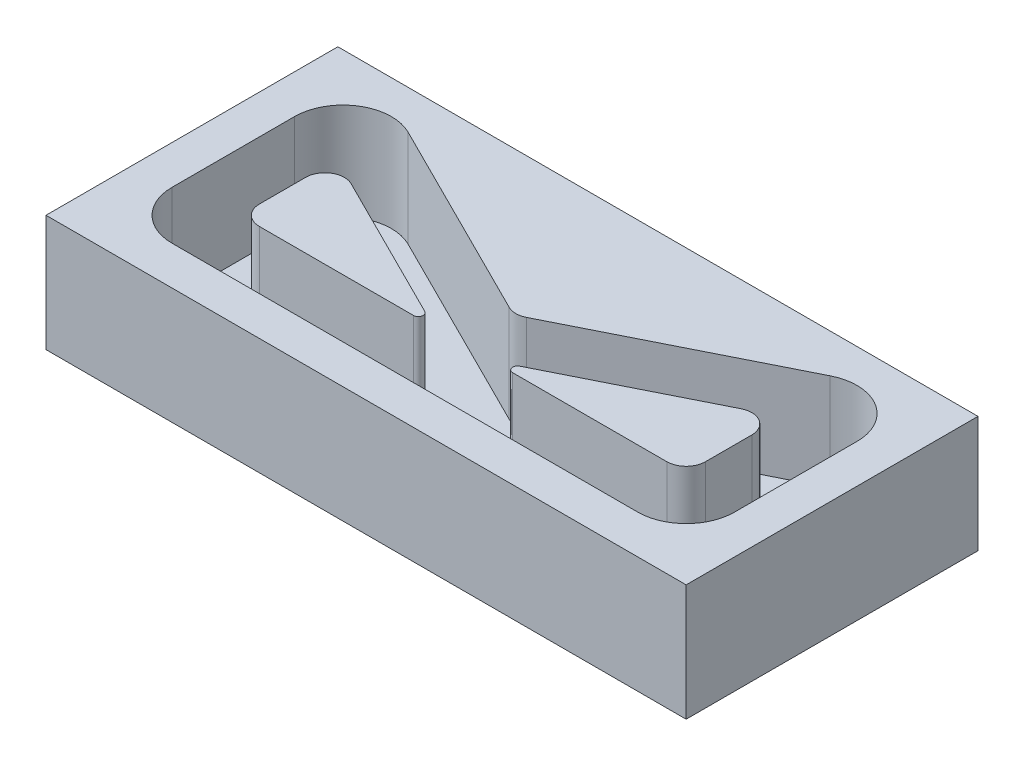
ISO-10303-21;
HEADER;
FILE_DESCRIPTION(('STEP AP214'),'2;1');
FILE_NAME('part.step','',(''),(''),'','','');
FILE_SCHEMA(('AUTOMOTIVE_DESIGN { 1 0 10303 214 1 1 1 1 }'));
ENDSEC;
DATA;
#1=APPLICATION_CONTEXT('core data for automotive mechanical design processes');
#2=APPLICATION_PROTOCOL_DEFINITION('international standard','automotive_design',2000,#1);
#3=PRODUCT_CONTEXT('',#1,'mechanical');
#4=PRODUCT('Part','Part','',(#3));
#5=PRODUCT_RELATED_PRODUCT_CATEGORY('part','',(#4));
#6=PRODUCT_DEFINITION_FORMATION('','',#4);
#7=PRODUCT_DEFINITION_CONTEXT('part definition',#1,'design');
#8=PRODUCT_DEFINITION('design','',#6,#7);
#9=PRODUCT_DEFINITION_SHAPE('','',#8);
#10=(LENGTH_UNIT() NAMED_UNIT(*) SI_UNIT(.MILLI.,.METRE.));
#11=(NAMED_UNIT(*) PLANE_ANGLE_UNIT() SI_UNIT($,.RADIAN.));
#12=(NAMED_UNIT(*) SI_UNIT($,.STERADIAN.) SOLID_ANGLE_UNIT());
#13=UNCERTAINTY_MEASURE_WITH_UNIT(LENGTH_MEASURE(1.E-05),#10,'distance_accuracy_value','');
#14=(GEOMETRIC_REPRESENTATION_CONTEXT(3) GLOBAL_UNCERTAINTY_ASSIGNED_CONTEXT((#13)) GLOBAL_UNIT_ASSIGNED_CONTEXT((#10,
#11,#12)) REPRESENTATION_CONTEXT('',''));
#15=CARTESIAN_POINT('',(0.,0.,0.));
#16=DIRECTION('',(0.,0.,1.));
#17=DIRECTION('',(1.,0.,0.));
#18=AXIS2_PLACEMENT_3D('',#15,#16,#17);
#19=CARTESIAN_POINT('',(0.,0.,0.));
#20=DIRECTION('',(0.,-1.,0.));
#21=DIRECTION('',(0.,0.,-1.));
#22=AXIS2_PLACEMENT_3D('',#19,#20,#21);
#23=PLANE('',#22);
#24=CARTESIAN_POINT('',(1.5,0.,-3.72213595499958));
#25=DIRECTION('',(0.,1.,0.));
#26=DIRECTION('',(0.,0.,1.));
#27=AXIS2_PLACEMENT_3D('',#24,#25,#26);
#28=CIRCLE('',#27,1.);
#29=CARTESIAN_POINT('',(1.94721359549996,0.,-2.82770876399967));
#30=VERTEX_POINT('',#29);
#31=CARTESIAN_POINT('',(1.05278640450004,0.,-2.82770876399967));
#32=VERTEX_POINT('',#31);
#33=EDGE_CURVE('E382',#30,#32,#28,.F.);
#34=ORIENTED_EDGE('',*,*,#33,.T.);
#35=DIRECTION('',(-0.894427190999916,0.,-0.447213595499958));
#36=VECTOR('',#35,1.);
#37=CARTESIAN_POINT('',(1.34164078649987,0.,-2.68328157299975));
#38=LINE('',#37,#36);
#39=CARTESIAN_POINT('',(-9.38196601125008,0.,-8.04508497187472));
#40=VERTEX_POINT('',#39);
#41=EDGE_CURVE('E387',#32,#40,#38,.T.);
#42=ORIENTED_EDGE('',*,*,#41,.T.);
#43=CARTESIAN_POINT('',(-10.5,0.,-5.80901699437495));
#44=DIRECTION('',(0.,1.,0.));
#45=DIRECTION('',(0.,0.,1.));
#46=AXIS2_PLACEMENT_3D('',#43,#44,#45);
#47=CIRCLE('',#46,2.5);
#48=CARTESIAN_POINT('',(-13.,0.,-5.80901699437492));
#49=VERTEX_POINT('',#48);
#50=EDGE_CURVE('E443',#40,#49,#47,.T.);
#51=ORIENTED_EDGE('',*,*,#50,.T.);
#52=DIRECTION('',(0.,0.,1.));
#53=VECTOR('',#52,1.);
#54=CARTESIAN_POINT('',(-13.,0.,0.));
#55=LINE('',#54,#53);
#56=CARTESIAN_POINT('',(-13.,0.,0.499999999999982));
#57=VERTEX_POINT('',#56);
#58=EDGE_CURVE('E440',#49,#57,#55,.T.);
#59=ORIENTED_EDGE('',*,*,#58,.T.);
#60=CARTESIAN_POINT('',(-10.5,0.,0.5));
#61=DIRECTION('',(0.,1.,0.));
#62=DIRECTION('',(0.,0.,1.));
#63=AXIS2_PLACEMENT_3D('',#60,#61,#62);
#64=CIRCLE('',#63,2.5);
#65=CARTESIAN_POINT('',(-10.5,0.,3.));
#66=VERTEX_POINT('',#65);
#67=EDGE_CURVE('E437',#66,#57,#64,.F.);
#68=ORIENTED_EDGE('',*,*,#67,.F.);
#69=DIRECTION('',(1.,0.,0.));
#70=VECTOR('',#69,1.);
#71=CARTESIAN_POINT('',(0.,0.,3.));
#72=LINE('',#71,#70);
#73=CARTESIAN_POINT('',(13.5,0.,3.));
#74=VERTEX_POINT('',#73);
#75=EDGE_CURVE('E434',#66,#74,#72,.T.);
#76=ORIENTED_EDGE('',*,*,#75,.T.);
#77=CARTESIAN_POINT('',(13.5,0.,0.5));
#78=DIRECTION('',(0.,1.,0.));
#79=DIRECTION('',(0.,0.,1.));
#80=AXIS2_PLACEMENT_3D('',#77,#78,#79);
#81=CIRCLE('',#80,2.5);
#82=CARTESIAN_POINT('',(16.,0.,0.499999999999982));
#83=VERTEX_POINT('',#82);
#84=EDGE_CURVE('E431',#74,#83,#81,.T.);
#85=ORIENTED_EDGE('',*,*,#84,.T.);
#86=DIRECTION('',(0.,0.,1.));
#87=VECTOR('',#86,1.);
#88=CARTESIAN_POINT('',(16.,0.,0.));
#89=LINE('',#88,#87);
#90=CARTESIAN_POINT('',(16.,0.,-5.80901699437492));
#91=VERTEX_POINT('',#90);
#92=EDGE_CURVE('E428',#91,#83,#89,.T.);
#93=ORIENTED_EDGE('',*,*,#92,.F.);
#94=CARTESIAN_POINT('',(13.5,0.,-5.80901699437495));
#95=DIRECTION('',(0.,1.,0.));
#96=DIRECTION('',(0.,0.,1.));
#97=AXIS2_PLACEMENT_3D('',#94,#95,#96);
#98=CIRCLE('',#97,2.5);
#99=CARTESIAN_POINT('',(12.3819660112501,0.,-8.04508497187472));
#100=VERTEX_POINT('',#99);
#101=EDGE_CURVE('E426',#100,#91,#98,.F.);
#102=ORIENTED_EDGE('',*,*,#101,.F.);
#103=DIRECTION('',(0.894427190999916,0.,-0.447213595499958));
#104=VECTOR('',#103,1.);
#105=CARTESIAN_POINT('',(-0.741640786499874,0.,-1.48328157299975));
#106=LINE('',#105,#104);
#107=EDGE_CURVE('E424',#30,#100,#106,.T.);
#108=ORIENTED_EDGE('',*,*,#107,.F.);
#109=EDGE_LOOP('',(#34,#42,#51,#59,#68,#76,#85,#93,#102,#108));
#110=FACE_BOUND('',#109,.T.);
#111=DIRECTION('',(1.,0.,0.));
#112=VECTOR('',#111,1.);
#113=CARTESIAN_POINT('',(0.,0.,0.));
#114=LINE('',#113,#112);
#115=CARTESIAN_POINT('',(-8.99999999999999,0.,0.));
#116=VERTEX_POINT('',#115);
#117=CARTESIAN_POINT('',(-1.05901699437496,0.,0.));
#118=VERTEX_POINT('',#117);
#119=EDGE_CURVE('E278',#116,#118,#114,.T.);
#120=ORIENTED_EDGE('',*,*,#119,.F.);
#121=CARTESIAN_POINT('',(-9.,0.,-1.));
#122=DIRECTION('',(0.,1.,0.));
#123=DIRECTION('',(0.,0.,1.));
#124=AXIS2_PLACEMENT_3D('',#121,#122,#123);
#125=CIRCLE('',#124,1.);
#126=CARTESIAN_POINT('',(-10.,0.,-1.00000000000001));
#127=VERTEX_POINT('',#126);
#128=EDGE_CURVE('E330',#116,#127,#125,.F.);
#129=ORIENTED_EDGE('',*,*,#128,.T.);
#130=DIRECTION('',(0.,0.,1.));
#131=VECTOR('',#130,1.);
#132=CARTESIAN_POINT('',(-10.,0.,0.));
#133=LINE('',#132,#131);
#134=CARTESIAN_POINT('',(-10.,0.,-3.38196601125009));
#135=VERTEX_POINT('',#134);
#136=EDGE_CURVE('E353',#135,#127,#133,.T.);
#137=ORIENTED_EDGE('',*,*,#136,.F.);
#138=CARTESIAN_POINT('',(-9.,0.,-3.38196601125011));
#139=DIRECTION('',(0.,1.,0.));
#140=DIRECTION('',(0.,0.,1.));
#141=AXIS2_PLACEMENT_3D('',#138,#139,#140);
#142=CIRCLE('',#141,1.);
#143=CARTESIAN_POINT('',(-8.55278640450003,0.,-4.27639320225001));
#144=VERTEX_POINT('',#143);
#145=EDGE_CURVE('E350',#135,#144,#142,.F.);
#146=ORIENTED_EDGE('',*,*,#145,.T.);
#147=DIRECTION('',(-0.894427190999916,0.,-0.447213595499958));
#148=VECTOR('',#147,1.);
#149=CARTESIAN_POINT('',(0.,0.,0.));
#150=LINE('',#149,#148);
#151=CARTESIAN_POINT('',(-0.947213595499973,0.,-0.473606797749986));
#152=VERTEX_POINT('',#151);
#153=EDGE_CURVE('E347',#152,#144,#150,.T.);
#154=ORIENTED_EDGE('',*,*,#153,.F.);
#155=CARTESIAN_POINT('',(-1.05901699437495,0.,-0.25));
#156=DIRECTION('',(0.,1.,0.));
#157=DIRECTION('',(0.,0.,1.));
#158=AXIS2_PLACEMENT_3D('',#155,#156,#157);
#159=CIRCLE('',#158,0.25);
#160=EDGE_CURVE('E345',#118,#152,#159,.T.);
#161=ORIENTED_EDGE('',*,*,#160,.F.);
#162=EDGE_LOOP('',(#120,#129,#137,#146,#154,#161));
#163=FACE_BOUND('',#162,.T.);
#164=CARTESIAN_POINT('',(4.05901699437495,0.,-0.25));
#165=DIRECTION('',(0.,1.,0.));
#166=DIRECTION('',(0.,0.,1.));
#167=AXIS2_PLACEMENT_3D('',#164,#165,#166);
#168=CIRCLE('',#167,0.25);
#169=CARTESIAN_POINT('',(3.94721359549997,0.,-0.473606797749986));
#170=VERTEX_POINT('',#169);
#171=CARTESIAN_POINT('',(4.05901699437496,0.,0.));
#172=VERTEX_POINT('',#171);
#173=EDGE_CURVE('E114',#170,#172,#168,.T.);
#174=ORIENTED_EDGE('',*,*,#173,.F.);
#175=DIRECTION('',(0.894427190999916,0.,-0.447213595499958));
#176=VECTOR('',#175,1.);
#177=CARTESIAN_POINT('',(0.6,0.,1.2));
#178=LINE('',#177,#176);
#179=CARTESIAN_POINT('',(11.5527864045,0.,-4.27639320225002));
#180=VERTEX_POINT('',#179);
#181=EDGE_CURVE('E276',#170,#180,#178,.T.);
#182=ORIENTED_EDGE('',*,*,#181,.T.);
#183=CARTESIAN_POINT('',(12.,0.,-3.38196601125011));
#184=DIRECTION('',(0.,1.,0.));
#185=DIRECTION('',(0.,0.,1.));
#186=AXIS2_PLACEMENT_3D('',#183,#184,#185);
#187=CIRCLE('',#186,1.);
#188=CARTESIAN_POINT('',(13.,0.,-3.38196601125009));
#189=VERTEX_POINT('',#188);
#190=EDGE_CURVE('E294',#189,#180,#187,.T.);
#191=ORIENTED_EDGE('',*,*,#190,.F.);
#192=DIRECTION('',(0.,0.,1.));
#193=VECTOR('',#192,1.);
#194=CARTESIAN_POINT('',(13.,0.,0.));
#195=LINE('',#194,#193);
#196=CARTESIAN_POINT('',(13.,0.,-1.00000000000001));
#197=VERTEX_POINT('',#196);
#198=EDGE_CURVE('E297',#189,#197,#195,.T.);
#199=ORIENTED_EDGE('',*,*,#198,.T.);
#200=CARTESIAN_POINT('',(12.,0.,-1.));
#201=DIRECTION('',(0.,1.,0.));
#202=DIRECTION('',(0.,0.,1.));
#203=AXIS2_PLACEMENT_3D('',#200,#201,#202);
#204=CIRCLE('',#203,1.);
#205=CARTESIAN_POINT('',(12.,0.,0.));
#206=VERTEX_POINT('',#205);
#207=EDGE_CURVE('E311',#206,#197,#204,.T.);
#208=ORIENTED_EDGE('',*,*,#207,.F.);
#209=DIRECTION('',(-1.,0.,0.));
#210=VECTOR('',#209,1.);
#211=CARTESIAN_POINT('',(0.,0.,0.));
#212=LINE('',#211,#210);
#213=EDGE_CURVE('E119',#206,#172,#212,.T.);
#214=ORIENTED_EDGE('',*,*,#213,.T.);
#215=EDGE_LOOP('',(#174,#182,#191,#199,#208,#214));
#216=FACE_BOUND('',#215,.T.);
#217=ADVANCED_FACE('F97',(#110,#163,#216),#23,.F.);
#218=CARTESIAN_POINT('',(0.,5.,5.));
#219=DIRECTION('',(0.,0.,-1.));
#220=DIRECTION('',(-1.,0.,0.));
#221=AXIS2_PLACEMENT_3D('',#218,#219,#220);
#222=PLANE('',#221);
#223=DIRECTION('',(0.,-1.,0.));
#224=VECTOR('',#223,1.);
#225=CARTESIAN_POINT('',(-15.,5.,5.));
#226=LINE('',#225,#224);
#227=CARTESIAN_POINT('',(-15.,5.,5.));
#228=VERTEX_POINT('',#227);
#229=CARTESIAN_POINT('',(-15.,-1.,5.));
#230=VERTEX_POINT('',#229);
#231=EDGE_CURVE('E448',#228,#230,#226,.T.);
#232=ORIENTED_EDGE('',*,*,#231,.T.);
#233=DIRECTION('',(-1.,0.,0.));
#234=VECTOR('',#233,1.);
#235=CARTESIAN_POINT('',(18.,-1.,5.));
#236=LINE('',#235,#234);
#237=CARTESIAN_POINT('',(18.,-1.,5.));
#238=VERTEX_POINT('',#237);
#239=EDGE_CURVE('E373',#238,#230,#236,.T.);
#240=ORIENTED_EDGE('',*,*,#239,.F.);
#241=DIRECTION('',(0.,-1.,0.));
#242=VECTOR('',#241,1.);
#243=CARTESIAN_POINT('',(18.,5.,5.));
#244=LINE('',#243,#242);
#245=CARTESIAN_POINT('',(18.,5.,5.));
#246=VERTEX_POINT('',#245);
#247=EDGE_CURVE('E12',#246,#238,#244,.T.);
#248=ORIENTED_EDGE('',*,*,#247,.F.);
#249=DIRECTION('',(1.,0.,0.));
#250=VECTOR('',#249,1.);
#251=CARTESIAN_POINT('',(0.,5.,5.));
#252=LINE('',#251,#250);
#253=EDGE_CURVE('E410',#228,#246,#252,.T.);
#254=ORIENTED_EDGE('',*,*,#253,.F.);
#255=EDGE_LOOP('',(#232,#240,#248,#254));
#256=FACE_BOUND('',#255,.T.);
#257=ADVANCED_FACE('F527',(#256),#222,.F.);
#258=CARTESIAN_POINT('',(18.,5.,0.));
#259=DIRECTION('',(-1.,0.,0.));
#260=DIRECTION('',(0.,0.,1.));
#261=AXIS2_PLACEMENT_3D('',#258,#259,#260);
#262=PLANE('',#261);
#263=ORIENTED_EDGE('',*,*,#247,.T.);
#264=DIRECTION('',(0.,0.,1.));
#265=VECTOR('',#264,1.);
#266=CARTESIAN_POINT('',(18.,-1.,-10.0450849718747));
#267=LINE('',#266,#265);
#268=CARTESIAN_POINT('',(18.,-1.,-10.0450849718747));
#269=VERTEX_POINT('',#268);
#270=EDGE_CURVE('E370',#269,#238,#267,.T.);
#271=ORIENTED_EDGE('',*,*,#270,.F.);
#272=DIRECTION('',(0.,-1.,0.));
#273=VECTOR('',#272,1.);
#274=CARTESIAN_POINT('',(18.,5.,-10.0450849718747));
#275=LINE('',#274,#273);
#276=CARTESIAN_POINT('',(18.,5.,-10.0450849718747));
#277=VERTEX_POINT('',#276);
#278=EDGE_CURVE('E106',#277,#269,#275,.T.);
#279=ORIENTED_EDGE('',*,*,#278,.F.);
#280=DIRECTION('',(0.,0.,-1.));
#281=VECTOR('',#280,1.);
#282=CARTESIAN_POINT('',(18.,5.,0.));
#283=LINE('',#282,#281);
#284=EDGE_CURVE('E413',#246,#277,#283,.T.);
#285=ORIENTED_EDGE('',*,*,#284,.F.);
#286=EDGE_LOOP('',(#263,#271,#279,#285));
#287=FACE_BOUND('',#286,.T.);
#288=ADVANCED_FACE('F532',(#287),#262,.F.);
#289=CARTESIAN_POINT('',(0.,5.,-10.0450849718747));
#290=DIRECTION('',(0.,0.,-1.));
#291=DIRECTION('',(-1.,0.,0.));
#292=AXIS2_PLACEMENT_3D('',#289,#290,#291);
#293=PLANE('',#292);
#294=ORIENTED_EDGE('',*,*,#278,.T.);
#295=DIRECTION('',(1.,0.,0.));
#296=VECTOR('',#295,1.);
#297=CARTESIAN_POINT('',(-15.,-1.,-10.0450849718747));
#298=LINE('',#297,#296);
#299=CARTESIAN_POINT('',(-15.,-1.,-10.0450849718747));
#300=VERTEX_POINT('',#299);
#301=EDGE_CURVE('E379',#300,#269,#298,.T.);
#302=ORIENTED_EDGE('',*,*,#301,.F.);
#303=DIRECTION('',(0.,-1.,0.));
#304=VECTOR('',#303,1.);
#305=CARTESIAN_POINT('',(-15.,5.,-10.0450849718747));
#306=LINE('',#305,#304);
#307=CARTESIAN_POINT('',(-15.,5.,-10.0450849718747));
#308=VERTEX_POINT('',#307);
#309=EDGE_CURVE('E450',#308,#300,#306,.T.);
#310=ORIENTED_EDGE('',*,*,#309,.F.);
#311=DIRECTION('',(1.,0.,0.));
#312=VECTOR('',#311,1.);
#313=CARTESIAN_POINT('',(0.,5.,-10.0450849718747));
#314=LINE('',#313,#312);
#315=EDGE_CURVE('E415',#308,#277,#314,.T.);
#316=ORIENTED_EDGE('',*,*,#315,.T.);
#317=EDGE_LOOP('',(#294,#302,#310,#316));
#318=FACE_BOUND('',#317,.T.);
#319=ADVANCED_FACE('F545',(#318),#293,.T.);
#320=CARTESIAN_POINT('',(1.5,5.,-3.72213595499958));
#321=DIRECTION('',(0.,-1.,0.));
#322=DIRECTION('',(0.,0.,-1.));
#323=AXIS2_PLACEMENT_3D('',#320,#321,#322);
#324=CYLINDRICAL_SURFACE('',#323,1.);
#325=ORIENTED_EDGE('',*,*,#33,.F.);
#326=DIRECTION('',(0.,-1.,0.));
#327=VECTOR('',#326,1.);
#328=CARTESIAN_POINT('',(1.94721359549996,5.,-2.82770876399967));
#329=LINE('',#328,#327);
#330=CARTESIAN_POINT('',(1.94721359549996,5.,-2.82770876399967));
#331=VERTEX_POINT('',#330);
#332=EDGE_CURVE('E101',#331,#30,#329,.T.);
#333=ORIENTED_EDGE('',*,*,#332,.F.);
#334=CARTESIAN_POINT('',(1.5,5.,-3.72213595499958));
#335=DIRECTION('',(0.,1.,0.));
#336=DIRECTION('',(0.,0.,1.));
#337=AXIS2_PLACEMENT_3D('',#334,#335,#336);
#338=CIRCLE('',#337,1.);
#339=CARTESIAN_POINT('',(1.05278640450004,5.,-2.82770876399967));
#340=VERTEX_POINT('',#339);
#341=EDGE_CURVE('E383',#331,#340,#338,.F.);
#342=ORIENTED_EDGE('',*,*,#341,.T.);
#343=DIRECTION('',(0.,-1.,0.));
#344=VECTOR('',#343,1.);
#345=CARTESIAN_POINT('',(1.05278640450004,5.,-2.82770876399967));
#346=LINE('',#345,#344);
#347=EDGE_CURVE('E421',#340,#32,#346,.T.);
#348=ORIENTED_EDGE('',*,*,#347,.T.);
#349=EDGE_LOOP('',(#325,#333,#342,#348));
#350=FACE_BOUND('',#349,.T.);
#351=ADVANCED_FACE('F99',(#350),#324,.T.);
#352=CARTESIAN_POINT('',(-0.741640786499874,5.,-1.48328157299975));
#353=DIRECTION('',(-0.447213595499958,0.,-0.894427190999916));
#354=DIRECTION('',(-0.894427190999916,0.,0.447213595499958));
#355=AXIS2_PLACEMENT_3D('',#352,#353,#354);
#356=PLANE('',#355);
#357=ORIENTED_EDGE('',*,*,#107,.T.);
#358=DIRECTION('',(0.,-1.,0.));
#359=VECTOR('',#358,1.);
#360=CARTESIAN_POINT('',(12.3819660112501,5.,-8.04508497187472));
#361=LINE('',#360,#359);
#362=CARTESIAN_POINT('',(12.3819660112501,5.,-8.04508497187472));
#363=VERTEX_POINT('',#362);
#364=EDGE_CURVE('E469',#363,#100,#361,.T.);
#365=ORIENTED_EDGE('',*,*,#364,.F.);
#366=DIRECTION('',(0.894427190999916,0.,-0.447213595499958));
#367=VECTOR('',#366,1.);
#368=CARTESIAN_POINT('',(-0.741640786499874,5.,-1.48328157299975));
#369=LINE('',#368,#367);
#370=EDGE_CURVE('E386',#331,#363,#369,.T.);
#371=ORIENTED_EDGE('',*,*,#370,.F.);
#372=ORIENTED_EDGE('',*,*,#332,.T.);
#373=EDGE_LOOP('',(#357,#365,#371,#372));
#374=FACE_BOUND('',#373,.T.);
#375=ADVANCED_FACE('F478',(#374),#356,.F.);
#376=CARTESIAN_POINT('',(13.5,5.,-5.80901699437495));
#377=DIRECTION('',(0.,-1.,0.));
#378=DIRECTION('',(0.,0.,-1.));
#379=AXIS2_PLACEMENT_3D('',#376,#377,#378);
#380=CYLINDRICAL_SURFACE('',#379,2.5);
#381=ORIENTED_EDGE('',*,*,#101,.T.);
#382=DIRECTION('',(0.,-1.,0.));
#383=VECTOR('',#382,1.);
#384=CARTESIAN_POINT('',(16.,5.,-5.80901699437492));
#385=LINE('',#384,#383);
#386=CARTESIAN_POINT('',(16.,5.,-5.80901699437492));
#387=VERTEX_POINT('',#386);
#388=EDGE_CURVE('E467',#387,#91,#385,.T.);
#389=ORIENTED_EDGE('',*,*,#388,.F.);
#390=CARTESIAN_POINT('',(13.5,5.,-5.80901699437495));
#391=DIRECTION('',(0.,1.,0.));
#392=DIRECTION('',(0.,0.,1.));
#393=AXIS2_PLACEMENT_3D('',#390,#391,#392);
#394=CIRCLE('',#393,2.5);
#395=EDGE_CURVE('E389',#363,#387,#394,.F.);
#396=ORIENTED_EDGE('',*,*,#395,.F.);
#397=ORIENTED_EDGE('',*,*,#364,.T.);
#398=EDGE_LOOP('',(#381,#389,#396,#397));
#399=FACE_BOUND('',#398,.T.);
#400=ADVANCED_FACE('F487',(#399),#380,.F.);
#401=CARTESIAN_POINT('',(16.,5.,0.));
#402=DIRECTION('',(1.,0.,0.));
#403=DIRECTION('',(0.,0.,-1.));
#404=AXIS2_PLACEMENT_3D('',#401,#402,#403);
#405=PLANE('',#404);
#406=ORIENTED_EDGE('',*,*,#92,.T.);
#407=DIRECTION('',(0.,-1.,0.));
#408=VECTOR('',#407,1.);
#409=CARTESIAN_POINT('',(16.,5.,0.499999999999982));
#410=LINE('',#409,#408);
#411=CARTESIAN_POINT('',(16.,5.,0.499999999999982));
#412=VERTEX_POINT('',#411);
#413=EDGE_CURVE('E465',#412,#83,#410,.T.);
#414=ORIENTED_EDGE('',*,*,#413,.F.);
#415=DIRECTION('',(0.,0.,1.));
#416=VECTOR('',#415,1.);
#417=CARTESIAN_POINT('',(16.,5.,0.));
#418=LINE('',#417,#416);
#419=EDGE_CURVE('E391',#387,#412,#418,.T.);
#420=ORIENTED_EDGE('',*,*,#419,.F.);
#421=ORIENTED_EDGE('',*,*,#388,.T.);
#422=EDGE_LOOP('',(#406,#414,#420,#421));
#423=FACE_BOUND('',#422,.T.);
#424=ADVANCED_FACE('F490',(#423),#405,.F.);
#425=CARTESIAN_POINT('',(13.5,5.,0.5));
#426=DIRECTION('',(0.,-1.,0.));
#427=DIRECTION('',(0.,0.,-1.));
#428=AXIS2_PLACEMENT_3D('',#425,#426,#427);
#429=CYLINDRICAL_SURFACE('',#428,2.5);
#430=ORIENTED_EDGE('',*,*,#84,.F.);
#431=DIRECTION('',(0.,-1.,0.));
#432=VECTOR('',#431,1.);
#433=CARTESIAN_POINT('',(13.5,5.,3.));
#434=LINE('',#433,#432);
#435=CARTESIAN_POINT('',(13.5,5.,3.));
#436=VERTEX_POINT('',#435);
#437=EDGE_CURVE('E463',#436,#74,#434,.T.);
#438=ORIENTED_EDGE('',*,*,#437,.F.);
#439=CARTESIAN_POINT('',(13.5,5.,0.5));
#440=DIRECTION('',(0.,1.,0.));
#441=DIRECTION('',(0.,0.,1.));
#442=AXIS2_PLACEMENT_3D('',#439,#440,#441);
#443=CIRCLE('',#442,2.5);
#444=EDGE_CURVE('E393',#436,#412,#443,.T.);
#445=ORIENTED_EDGE('',*,*,#444,.T.);
#446=ORIENTED_EDGE('',*,*,#413,.T.);
#447=EDGE_LOOP('',(#430,#438,#445,#446));
#448=FACE_BOUND('',#447,.T.);
#449=ADVANCED_FACE('F517',(#448),#429,.F.);
#450=CARTESIAN_POINT('',(0.,5.,3.));
#451=DIRECTION('',(0.,0.,-1.));
#452=DIRECTION('',(-1.,0.,0.));
#453=AXIS2_PLACEMENT_3D('',#450,#451,#452);
#454=PLANE('',#453);
#455=ORIENTED_EDGE('',*,*,#75,.F.);
#456=DIRECTION('',(0.,-1.,0.));
#457=VECTOR('',#456,1.);
#458=CARTESIAN_POINT('',(-10.5,5.,3.));
#459=LINE('',#458,#457);
#460=CARTESIAN_POINT('',(-10.5,5.,3.));
#461=VERTEX_POINT('',#460);
#462=EDGE_CURVE('E461',#461,#66,#459,.T.);
#463=ORIENTED_EDGE('',*,*,#462,.F.);
#464=DIRECTION('',(1.,0.,0.));
#465=VECTOR('',#464,1.);
#466=CARTESIAN_POINT('',(0.,5.,3.));
#467=LINE('',#466,#465);
#468=EDGE_CURVE('E396',#461,#436,#467,.T.);
#469=ORIENTED_EDGE('',*,*,#468,.T.);
#470=ORIENTED_EDGE('',*,*,#437,.T.);
#471=EDGE_LOOP('',(#455,#463,#469,#470));
#472=FACE_BOUND('',#471,.T.);
#473=ADVANCED_FACE('F515',(#472),#454,.T.);
#474=CARTESIAN_POINT('',(-10.5,5.,0.5));
#475=DIRECTION('',(0.,-1.,0.));
#476=DIRECTION('',(0.,0.,-1.));
#477=AXIS2_PLACEMENT_3D('',#474,#475,#476);
#478=CYLINDRICAL_SURFACE('',#477,2.5);
#479=ORIENTED_EDGE('',*,*,#67,.T.);
#480=DIRECTION('',(0.,-1.,0.));
#481=VECTOR('',#480,1.);
#482=CARTESIAN_POINT('',(-13.,5.,0.499999999999982));
#483=LINE('',#482,#481);
#484=CARTESIAN_POINT('',(-13.,5.,0.499999999999982));
#485=VERTEX_POINT('',#484);
#486=EDGE_CURVE('E459',#485,#57,#483,.T.);
#487=ORIENTED_EDGE('',*,*,#486,.F.);
#488=CARTESIAN_POINT('',(-10.5,5.,0.5));
#489=DIRECTION('',(0.,1.,0.));
#490=DIRECTION('',(0.,0.,1.));
#491=AXIS2_PLACEMENT_3D('',#488,#489,#490);
#492=CIRCLE('',#491,2.5);
#493=EDGE_CURVE('E399',#461,#485,#492,.F.);
#494=ORIENTED_EDGE('',*,*,#493,.F.);
#495=ORIENTED_EDGE('',*,*,#462,.T.);
#496=EDGE_LOOP('',(#479,#487,#494,#495));
#497=FACE_BOUND('',#496,.T.);
#498=ADVANCED_FACE('F511',(#497),#478,.F.);
#499=CARTESIAN_POINT('',(-13.,5.,0.));
#500=DIRECTION('',(1.,0.,0.));
#501=DIRECTION('',(0.,0.,-1.));
#502=AXIS2_PLACEMENT_3D('',#499,#500,#501);
#503=PLANE('',#502);
#504=ORIENTED_EDGE('',*,*,#58,.F.);
#505=DIRECTION('',(0.,-1.,0.));
#506=VECTOR('',#505,1.);
#507=CARTESIAN_POINT('',(-13.,5.,-5.80901699437492));
#508=LINE('',#507,#506);
#509=CARTESIAN_POINT('',(-13.,5.,-5.80901699437492));
#510=VERTEX_POINT('',#509);
#511=EDGE_CURVE('E457',#510,#49,#508,.T.);
#512=ORIENTED_EDGE('',*,*,#511,.F.);
#513=DIRECTION('',(0.,0.,1.));
#514=VECTOR('',#513,1.);
#515=CARTESIAN_POINT('',(-13.,5.,0.));
#516=LINE('',#515,#514);
#517=EDGE_CURVE('E401',#510,#485,#516,.T.);
#518=ORIENTED_EDGE('',*,*,#517,.T.);
#519=ORIENTED_EDGE('',*,*,#486,.T.);
#520=EDGE_LOOP('',(#504,#512,#518,#519));
#521=FACE_BOUND('',#520,.T.);
#522=ADVANCED_FACE('F507',(#521),#503,.T.);
#523=CARTESIAN_POINT('',(-10.5,5.,-5.80901699437495));
#524=DIRECTION('',(0.,-1.,0.));
#525=DIRECTION('',(0.,0.,-1.));
#526=AXIS2_PLACEMENT_3D('',#523,#524,#525);
#527=CYLINDRICAL_SURFACE('',#526,2.5);
#528=ORIENTED_EDGE('',*,*,#50,.F.);
#529=DIRECTION('',(0.,-1.,0.));
#530=VECTOR('',#529,1.);
#531=CARTESIAN_POINT('',(-9.38196601125008,5.,-8.04508497187472));
#532=LINE('',#531,#530);
#533=CARTESIAN_POINT('',(-9.38196601125008,5.,-8.04508497187472));
#534=VERTEX_POINT('',#533);
#535=EDGE_CURVE('E454',#534,#40,#532,.T.);
#536=ORIENTED_EDGE('',*,*,#535,.F.);
#537=CARTESIAN_POINT('',(-10.5,5.,-5.80901699437495));
#538=DIRECTION('',(0.,1.,0.));
#539=DIRECTION('',(0.,0.,1.));
#540=AXIS2_PLACEMENT_3D('',#537,#538,#539);
#541=CIRCLE('',#540,2.5);
#542=EDGE_CURVE('E404',#534,#510,#541,.T.);
#543=ORIENTED_EDGE('',*,*,#542,.T.);
#544=ORIENTED_EDGE('',*,*,#511,.T.);
#545=EDGE_LOOP('',(#528,#536,#543,#544));
#546=FACE_BOUND('',#545,.T.);
#547=ADVANCED_FACE('F505',(#546),#527,.F.);
#548=CARTESIAN_POINT('',(1.34164078649987,5.,-2.68328157299975));
#549=DIRECTION('',(-0.447213595499958,0.,0.894427190999916));
#550=DIRECTION('',(0.894427190999916,0.,0.447213595499958));
#551=AXIS2_PLACEMENT_3D('',#548,#549,#550);
#552=PLANE('',#551);
#553=ORIENTED_EDGE('',*,*,#41,.F.);
#554=ORIENTED_EDGE('',*,*,#347,.F.);
#555=DIRECTION('',(-0.894427190999916,0.,-0.447213595499958));
#556=VECTOR('',#555,1.);
#557=CARTESIAN_POINT('',(1.34164078649987,5.,-2.68328157299975));
#558=LINE('',#557,#556);
#559=EDGE_CURVE('E407',#340,#534,#558,.T.);
#560=ORIENTED_EDGE('',*,*,#559,.T.);
#561=ORIENTED_EDGE('',*,*,#535,.T.);
#562=EDGE_LOOP('',(#553,#554,#560,#561));
#563=FACE_BOUND('',#562,.T.);
#564=ADVANCED_FACE('F501',(#563),#552,.T.);
#565=CARTESIAN_POINT('',(-15.,5.,0.));
#566=DIRECTION('',(-1.,0.,0.));
#567=DIRECTION('',(0.,0.,1.));
#568=AXIS2_PLACEMENT_3D('',#565,#566,#567);
#569=PLANE('',#568);
#570=ORIENTED_EDGE('',*,*,#309,.T.);
#571=DIRECTION('',(0.,0.,-1.));
#572=VECTOR('',#571,1.);
#573=CARTESIAN_POINT('',(-15.,-1.,5.));
#574=LINE('',#573,#572);
#575=EDGE_CURVE('E376',#230,#300,#574,.T.);
#576=ORIENTED_EDGE('',*,*,#575,.F.);
#577=ORIENTED_EDGE('',*,*,#231,.F.);
#578=DIRECTION('',(0.,0.,-1.));
#579=VECTOR('',#578,1.);
#580=CARTESIAN_POINT('',(-15.,5.,0.));
#581=LINE('',#580,#579);
#582=EDGE_CURVE('E418',#228,#308,#581,.T.);
#583=ORIENTED_EDGE('',*,*,#582,.T.);
#584=EDGE_LOOP('',(#570,#576,#577,#583));
#585=FACE_BOUND('',#584,.T.);
#586=ADVANCED_FACE('F541',(#585),#569,.T.);
#587=CARTESIAN_POINT('',(0.,5.,0.));
#588=DIRECTION('',(0.,1.,0.));
#589=DIRECTION('',(0.,0.,1.));
#590=AXIS2_PLACEMENT_3D('',#587,#588,#589);
#591=PLANE('',#590);
#592=ORIENTED_EDGE('',*,*,#341,.F.);
#593=ORIENTED_EDGE('',*,*,#370,.T.);
#594=ORIENTED_EDGE('',*,*,#395,.T.);
#595=ORIENTED_EDGE('',*,*,#419,.T.);
#596=ORIENTED_EDGE('',*,*,#444,.F.);
#597=ORIENTED_EDGE('',*,*,#468,.F.);
#598=ORIENTED_EDGE('',*,*,#493,.T.);
#599=ORIENTED_EDGE('',*,*,#517,.F.);
#600=ORIENTED_EDGE('',*,*,#542,.F.);
#601=ORIENTED_EDGE('',*,*,#559,.F.);
#602=EDGE_LOOP('',(#592,#593,#594,#595,#596,#597,#598,#599,#600,#601));
#603=FACE_BOUND('',#602,.T.);
#604=ORIENTED_EDGE('',*,*,#253,.T.);
#605=ORIENTED_EDGE('',*,*,#284,.T.);
#606=ORIENTED_EDGE('',*,*,#315,.F.);
#607=ORIENTED_EDGE('',*,*,#582,.F.);
#608=EDGE_LOOP('',(#604,#605,#606,#607));
#609=FACE_BOUND('',#608,.T.);
#610=ADVANCED_FACE('F494',(#603,#609),#591,.T.);
#611=CARTESIAN_POINT('',(0.,-1.,0.));
#612=DIRECTION('',(0.,-1.,0.));
#613=DIRECTION('',(0.,0.,-1.));
#614=AXIS2_PLACEMENT_3D('',#611,#612,#613);
#615=PLANE('',#614);
#616=ORIENTED_EDGE('',*,*,#270,.T.);
#617=ORIENTED_EDGE('',*,*,#239,.T.);
#618=ORIENTED_EDGE('',*,*,#575,.T.);
#619=ORIENTED_EDGE('',*,*,#301,.T.);
#620=EDGE_LOOP('',(#616,#617,#618,#619));
#621=FACE_BOUND('',#620,.T.);
#622=ADVANCED_FACE('F537',(#621),#615,.T.);
#623=CARTESIAN_POINT('',(0.,5.,0.));
#624=DIRECTION('',(0.,0.,-1.));
#625=DIRECTION('',(-1.,0.,0.));
#626=AXIS2_PLACEMENT_3D('',#623,#624,#625);
#627=PLANE('',#626);
#628=ORIENTED_EDGE('',*,*,#119,.T.);
#629=DIRECTION('',(0.,-1.,0.));
#630=VECTOR('',#629,1.);
#631=CARTESIAN_POINT('',(-1.05901699437496,5.,0.));
#632=LINE('',#631,#630);
#633=CARTESIAN_POINT('',(-1.05901699437496,5.,0.));
#634=VERTEX_POINT('',#633);
#635=EDGE_CURVE('E368',#634,#118,#632,.T.);
#636=ORIENTED_EDGE('',*,*,#635,.F.);
#637=DIRECTION('',(1.,0.,0.));
#638=VECTOR('',#637,1.);
#639=CARTESIAN_POINT('',(0.,5.,0.));
#640=LINE('',#639,#638);
#641=CARTESIAN_POINT('',(-8.99999999999999,5.,0.));
#642=VERTEX_POINT('',#641);
#643=EDGE_CURVE('E326',#642,#634,#640,.T.);
#644=ORIENTED_EDGE('',*,*,#643,.F.);
#645=DIRECTION('',(0.,-1.,0.));
#646=VECTOR('',#645,1.);
#647=CARTESIAN_POINT('',(-8.99999999999999,5.,0.));
#648=LINE('',#647,#646);
#649=EDGE_CURVE('E342',#642,#116,#648,.T.);
#650=ORIENTED_EDGE('',*,*,#649,.T.);
#651=EDGE_LOOP('',(#628,#636,#644,#650));
#652=FACE_BOUND('',#651,.T.);
#653=ADVANCED_FACE('F589',(#652),#627,.F.);
#654=CARTESIAN_POINT('',(-1.05901699437495,5.,-0.25));
#655=DIRECTION('',(0.,-1.,0.));
#656=DIRECTION('',(0.,0.,-1.));
#657=AXIS2_PLACEMENT_3D('',#654,#655,#656);
#658=CYLINDRICAL_SURFACE('',#657,0.25);
#659=ORIENTED_EDGE('',*,*,#160,.T.);
#660=DIRECTION('',(0.,-1.,0.));
#661=VECTOR('',#660,1.);
#662=CARTESIAN_POINT('',(-0.947213595499973,5.,-0.473606797749986));
#663=LINE('',#662,#661);
#664=CARTESIAN_POINT('',(-0.947213595499973,5.,-0.473606797749986));
#665=VERTEX_POINT('',#664);
#666=EDGE_CURVE('E365',#665,#152,#663,.T.);
#667=ORIENTED_EDGE('',*,*,#666,.F.);
#668=CARTESIAN_POINT('',(-1.05901699437495,5.,-0.25));
#669=DIRECTION('',(0.,1.,0.));
#670=DIRECTION('',(0.,0.,1.));
#671=AXIS2_PLACEMENT_3D('',#668,#669,#670);
#672=CIRCLE('',#671,0.25);
#673=EDGE_CURVE('E329',#634,#665,#672,.T.);
#674=ORIENTED_EDGE('',*,*,#673,.F.);
#675=ORIENTED_EDGE('',*,*,#635,.T.);
#676=EDGE_LOOP('',(#659,#667,#674,#675));
#677=FACE_BOUND('',#676,.T.);
#678=ADVANCED_FACE('F596',(#677),#658,.T.);
#679=CARTESIAN_POINT('',(0.,5.,0.));
#680=DIRECTION('',(-0.447213595499958,0.,0.894427190999916));
#681=DIRECTION('',(0.894427190999916,0.,0.447213595499958));
#682=AXIS2_PLACEMENT_3D('',#679,#680,#681);
#683=PLANE('',#682);
#684=ORIENTED_EDGE('',*,*,#153,.T.);
#685=DIRECTION('',(0.,-1.,0.));
#686=VECTOR('',#685,1.);
#687=CARTESIAN_POINT('',(-8.55278640450003,5.,-4.27639320225001));
#688=LINE('',#687,#686);
#689=CARTESIAN_POINT('',(-8.55278640450003,5.,-4.27639320225001));
#690=VERTEX_POINT('',#689);
#691=EDGE_CURVE('E363',#690,#144,#688,.T.);
#692=ORIENTED_EDGE('',*,*,#691,.F.);
#693=DIRECTION('',(-0.894427190999916,0.,-0.447213595499958));
#694=VECTOR('',#693,1.);
#695=CARTESIAN_POINT('',(0.,5.,0.));
#696=LINE('',#695,#694);
#697=EDGE_CURVE('E332',#665,#690,#696,.T.);
#698=ORIENTED_EDGE('',*,*,#697,.F.);
#699=ORIENTED_EDGE('',*,*,#666,.T.);
#700=EDGE_LOOP('',(#684,#692,#698,#699));
#701=FACE_BOUND('',#700,.T.);
#702=ADVANCED_FACE('F603',(#701),#683,.F.);
#703=CARTESIAN_POINT('',(-9.,5.,-3.38196601125011));
#704=DIRECTION('',(0.,-1.,0.));
#705=DIRECTION('',(0.,0.,-1.));
#706=AXIS2_PLACEMENT_3D('',#703,#704,#705);
#707=CYLINDRICAL_SURFACE('',#706,1.);
#708=ORIENTED_EDGE('',*,*,#145,.F.);
#709=DIRECTION('',(0.,-1.,0.));
#710=VECTOR('',#709,1.);
#711=CARTESIAN_POINT('',(-10.,5.,-3.38196601125009));
#712=LINE('',#711,#710);
#713=CARTESIAN_POINT('',(-10.,5.,-3.38196601125009));
#714=VERTEX_POINT('',#713);
#715=EDGE_CURVE('E361',#714,#135,#712,.T.);
#716=ORIENTED_EDGE('',*,*,#715,.F.);
#717=CARTESIAN_POINT('',(-9.,5.,-3.38196601125011));
#718=DIRECTION('',(0.,1.,0.));
#719=DIRECTION('',(0.,0.,1.));
#720=AXIS2_PLACEMENT_3D('',#717,#718,#719);
#721=CIRCLE('',#720,1.);
#722=EDGE_CURVE('E334',#714,#690,#721,.F.);
#723=ORIENTED_EDGE('',*,*,#722,.T.);
#724=ORIENTED_EDGE('',*,*,#691,.T.);
#725=EDGE_LOOP('',(#708,#716,#723,#724));
#726=FACE_BOUND('',#725,.T.);
#727=ADVANCED_FACE('F611',(#726),#707,.T.);
#728=CARTESIAN_POINT('',(-10.,5.,0.));
#729=DIRECTION('',(1.,0.,0.));
#730=DIRECTION('',(0.,0.,-1.));
#731=AXIS2_PLACEMENT_3D('',#728,#729,#730);
#732=PLANE('',#731);
#733=ORIENTED_EDGE('',*,*,#136,.T.);
#734=DIRECTION('',(0.,-1.,0.));
#735=VECTOR('',#734,1.);
#736=CARTESIAN_POINT('',(-10.,5.,-1.00000000000001));
#737=LINE('',#736,#735);
#738=CARTESIAN_POINT('',(-10.,5.,-1.00000000000001));
#739=VERTEX_POINT('',#738);
#740=EDGE_CURVE('E358',#739,#127,#737,.T.);
#741=ORIENTED_EDGE('',*,*,#740,.F.);
#742=DIRECTION('',(0.,0.,1.));
#743=VECTOR('',#742,1.);
#744=CARTESIAN_POINT('',(-10.,5.,0.));
#745=LINE('',#744,#743);
#746=EDGE_CURVE('E337',#714,#739,#745,.T.);
#747=ORIENTED_EDGE('',*,*,#746,.F.);
#748=ORIENTED_EDGE('',*,*,#715,.T.);
#749=EDGE_LOOP('',(#733,#741,#747,#748));
#750=FACE_BOUND('',#749,.T.);
#751=ADVANCED_FACE('F619',(#750),#732,.F.);
#752=CARTESIAN_POINT('',(-9.,5.,-1.));
#753=DIRECTION('',(0.,-1.,0.));
#754=DIRECTION('',(0.,0.,-1.));
#755=AXIS2_PLACEMENT_3D('',#752,#753,#754);
#756=CYLINDRICAL_SURFACE('',#755,1.);
#757=ORIENTED_EDGE('',*,*,#128,.F.);
#758=ORIENTED_EDGE('',*,*,#649,.F.);
#759=CARTESIAN_POINT('',(-9.,5.,-1.));
#760=DIRECTION('',(0.,1.,0.));
#761=DIRECTION('',(0.,0.,1.));
#762=AXIS2_PLACEMENT_3D('',#759,#760,#761);
#763=CIRCLE('',#762,1.);
#764=EDGE_CURVE('E339',#642,#739,#763,.F.);
#765=ORIENTED_EDGE('',*,*,#764,.T.);
#766=ORIENTED_EDGE('',*,*,#740,.T.);
#767=EDGE_LOOP('',(#757,#758,#765,#766));
#768=FACE_BOUND('',#767,.T.);
#769=ADVANCED_FACE('F627',(#768),#756,.T.);
#770=CARTESIAN_POINT('',(0.,5.,0.));
#771=DIRECTION('',(0.,1.,0.));
#772=DIRECTION('',(0.,0.,1.));
#773=AXIS2_PLACEMENT_3D('',#770,#771,#772);
#774=PLANE('',#773);
#775=ORIENTED_EDGE('',*,*,#643,.T.);
#776=ORIENTED_EDGE('',*,*,#673,.T.);
#777=ORIENTED_EDGE('',*,*,#697,.T.);
#778=ORIENTED_EDGE('',*,*,#722,.F.);
#779=ORIENTED_EDGE('',*,*,#746,.T.);
#780=ORIENTED_EDGE('',*,*,#764,.F.);
#781=EDGE_LOOP('',(#775,#776,#777,#778,#779,#780));
#782=FACE_BOUND('',#781,.T.);
#783=ADVANCED_FACE('F635',(#782),#774,.T.);
#784=CARTESIAN_POINT('',(0.6,5.,1.2));
#785=DIRECTION('',(-0.447213595499958,0.,-0.894427190999916));
#786=DIRECTION('',(-0.894427190999916,0.,0.447213595499958));
#787=AXIS2_PLACEMENT_3D('',#784,#785,#786);
#788=PLANE('',#787);
#789=ORIENTED_EDGE('',*,*,#181,.F.);
#790=DIRECTION('',(0.,-1.,0.));
#791=VECTOR('',#790,1.);
#792=CARTESIAN_POINT('',(3.94721359549997,5.,-0.473606797749986));
#793=LINE('',#792,#791);
#794=CARTESIAN_POINT('',(3.94721359549997,5.,-0.473606797749986));
#795=VERTEX_POINT('',#794);
#796=EDGE_CURVE('E270',#795,#170,#793,.T.);
#797=ORIENTED_EDGE('',*,*,#796,.F.);
#798=DIRECTION('',(0.894427190999916,0.,-0.447213595499958));
#799=VECTOR('',#798,1.);
#800=CARTESIAN_POINT('',(0.6,5.,1.2));
#801=LINE('',#800,#799);
#802=CARTESIAN_POINT('',(11.5527864045,5.,-4.27639320225002));
#803=VERTEX_POINT('',#802);
#804=EDGE_CURVE('E275',#795,#803,#801,.T.);
#805=ORIENTED_EDGE('',*,*,#804,.T.);
#806=DIRECTION('',(0.,-1.,0.));
#807=VECTOR('',#806,1.);
#808=CARTESIAN_POINT('',(11.5527864045,5.,-4.27639320225002));
#809=LINE('',#808,#807);
#810=EDGE_CURVE('E307',#803,#180,#809,.T.);
#811=ORIENTED_EDGE('',*,*,#810,.T.);
#812=EDGE_LOOP('',(#789,#797,#805,#811));
#813=FACE_BOUND('',#812,.T.);
#814=ADVANCED_FACE('F272',(#813),#788,.T.);
#815=CARTESIAN_POINT('',(4.05901699437495,5.,-0.25));
#816=DIRECTION('',(0.,-1.,0.));
#817=DIRECTION('',(0.,0.,-1.));
#818=AXIS2_PLACEMENT_3D('',#815,#816,#817);
#819=CYLINDRICAL_SURFACE('',#818,0.25);
#820=ORIENTED_EDGE('',*,*,#173,.T.);
#821=DIRECTION('',(0.,-1.,0.));
#822=VECTOR('',#821,1.);
#823=CARTESIAN_POINT('',(4.05901699437496,5.,0.));
#824=LINE('',#823,#822);
#825=CARTESIAN_POINT('',(4.05901699437496,5.,0.));
#826=VERTEX_POINT('',#825);
#827=EDGE_CURVE('E279',#826,#172,#824,.T.);
#828=ORIENTED_EDGE('',*,*,#827,.F.);
#829=CARTESIAN_POINT('',(4.05901699437495,5.,-0.25));
#830=DIRECTION('',(0.,1.,0.));
#831=DIRECTION('',(0.,0.,1.));
#832=AXIS2_PLACEMENT_3D('',#829,#830,#831);
#833=CIRCLE('',#832,0.25);
#834=EDGE_CURVE('E282',#795,#826,#833,.T.);
#835=ORIENTED_EDGE('',*,*,#834,.F.);
#836=ORIENTED_EDGE('',*,*,#796,.T.);
#837=EDGE_LOOP('',(#820,#828,#835,#836));
#838=FACE_BOUND('',#837,.T.);
#839=ADVANCED_FACE('F283',(#838),#819,.T.);
#840=CARTESIAN_POINT('',(0.,5.,0.));
#841=DIRECTION('',(0.,0.,1.));
#842=DIRECTION('',(1.,0.,0.));
#843=AXIS2_PLACEMENT_3D('',#840,#841,#842);
#844=PLANE('',#843);
#845=ORIENTED_EDGE('',*,*,#213,.F.);
#846=DIRECTION('',(0.,-1.,0.));
#847=VECTOR('',#846,1.);
#848=CARTESIAN_POINT('',(12.,5.,0.));
#849=LINE('',#848,#847);
#850=CARTESIAN_POINT('',(12.,5.,0.));
#851=VERTEX_POINT('',#850);
#852=EDGE_CURVE('E322',#851,#206,#849,.T.);
#853=ORIENTED_EDGE('',*,*,#852,.F.);
#854=DIRECTION('',(-1.,0.,0.));
#855=VECTOR('',#854,1.);
#856=CARTESIAN_POINT('',(0.,5.,0.));
#857=LINE('',#856,#855);
#858=EDGE_CURVE('E287',#851,#826,#857,.T.);
#859=ORIENTED_EDGE('',*,*,#858,.T.);
#860=ORIENTED_EDGE('',*,*,#827,.T.);
#861=EDGE_LOOP('',(#845,#853,#859,#860));
#862=FACE_BOUND('',#861,.T.);
#863=ADVANCED_FACE('F656',(#862),#844,.T.);
#864=CARTESIAN_POINT('',(12.,5.,-1.));
#865=DIRECTION('',(0.,-1.,0.));
#866=DIRECTION('',(0.,0.,-1.));
#867=AXIS2_PLACEMENT_3D('',#864,#865,#866);
#868=CYLINDRICAL_SURFACE('',#867,1.);
#869=ORIENTED_EDGE('',*,*,#207,.T.);
#870=DIRECTION('',(0.,-1.,0.));
#871=VECTOR('',#870,1.);
#872=CARTESIAN_POINT('',(13.,5.,-1.00000000000001));
#873=LINE('',#872,#871);
#874=CARTESIAN_POINT('',(13.,5.,-1.00000000000001));
#875=VERTEX_POINT('',#874);
#876=EDGE_CURVE('E319',#875,#197,#873,.T.);
#877=ORIENTED_EDGE('',*,*,#876,.F.);
#878=CARTESIAN_POINT('',(12.,5.,-1.));
#879=DIRECTION('',(0.,1.,0.));
#880=DIRECTION('',(0.,0.,1.));
#881=AXIS2_PLACEMENT_3D('',#878,#879,#880);
#882=CIRCLE('',#881,1.);
#883=EDGE_CURVE('E301',#851,#875,#882,.T.);
#884=ORIENTED_EDGE('',*,*,#883,.F.);
#885=ORIENTED_EDGE('',*,*,#852,.T.);
#886=EDGE_LOOP('',(#869,#877,#884,#885));
#887=FACE_BOUND('',#886,.T.);
#888=ADVANCED_FACE('F663',(#887),#868,.T.);
#889=CARTESIAN_POINT('',(13.,5.,0.));
#890=DIRECTION('',(1.,0.,0.));
#891=DIRECTION('',(0.,0.,-1.));
#892=AXIS2_PLACEMENT_3D('',#889,#890,#891);
#893=PLANE('',#892);
#894=ORIENTED_EDGE('',*,*,#198,.F.);
#895=DIRECTION('',(0.,-1.,0.));
#896=VECTOR('',#895,1.);
#897=CARTESIAN_POINT('',(13.,5.,-3.38196601125009));
#898=LINE('',#897,#896);
#899=CARTESIAN_POINT('',(13.,5.,-3.38196601125009));
#900=VERTEX_POINT('',#899);
#901=EDGE_CURVE('E316',#900,#189,#898,.T.);
#902=ORIENTED_EDGE('',*,*,#901,.F.);
#903=DIRECTION('',(0.,0.,1.));
#904=VECTOR('',#903,1.);
#905=CARTESIAN_POINT('',(13.,5.,0.));
#906=LINE('',#905,#904);
#907=EDGE_CURVE('E303',#900,#875,#906,.T.);
#908=ORIENTED_EDGE('',*,*,#907,.T.);
#909=ORIENTED_EDGE('',*,*,#876,.T.);
#910=EDGE_LOOP('',(#894,#902,#908,#909));
#911=FACE_BOUND('',#910,.T.);
#912=ADVANCED_FACE('F671',(#911),#893,.T.);
#913=CARTESIAN_POINT('',(12.,5.,-3.38196601125011));
#914=DIRECTION('',(0.,-1.,0.));
#915=DIRECTION('',(0.,0.,-1.));
#916=AXIS2_PLACEMENT_3D('',#913,#914,#915);
#917=CYLINDRICAL_SURFACE('',#916,1.);
#918=ORIENTED_EDGE('',*,*,#190,.T.);
#919=ORIENTED_EDGE('',*,*,#810,.F.);
#920=CARTESIAN_POINT('',(12.,5.,-3.38196601125011));
#921=DIRECTION('',(0.,1.,0.));
#922=DIRECTION('',(0.,0.,1.));
#923=AXIS2_PLACEMENT_3D('',#920,#921,#922);
#924=CIRCLE('',#923,1.);
#925=EDGE_CURVE('E292',#900,#803,#924,.T.);
#926=ORIENTED_EDGE('',*,*,#925,.F.);
#927=ORIENTED_EDGE('',*,*,#901,.T.);
#928=EDGE_LOOP('',(#918,#919,#926,#927));
#929=FACE_BOUND('',#928,.T.);
#930=ADVANCED_FACE('F679',(#929),#917,.T.);
#931=CARTESIAN_POINT('',(0.,5.,0.));
#932=DIRECTION('',(0.,1.,0.));
#933=DIRECTION('',(0.,0.,1.));
#934=AXIS2_PLACEMENT_3D('',#931,#932,#933);
#935=PLANE('',#934);
#936=ORIENTED_EDGE('',*,*,#804,.F.);
#937=ORIENTED_EDGE('',*,*,#834,.T.);
#938=ORIENTED_EDGE('',*,*,#858,.F.);
#939=ORIENTED_EDGE('',*,*,#883,.T.);
#940=ORIENTED_EDGE('',*,*,#907,.F.);
#941=ORIENTED_EDGE('',*,*,#925,.T.);
#942=EDGE_LOOP('',(#936,#937,#938,#939,#940,#941));
#943=FACE_BOUND('',#942,.T.);
#944=ADVANCED_FACE('F289',(#943),#935,.T.);
#945=CLOSED_SHELL('',(#217,#257,#288,#319,#351,#375,#400,#424,#449,#473,#498,#522,#547,#564,
#586,#610,#622,#653,#678,#702,#727,#751,#769,#783,#814,#839,#863,#888,#912,#930,#944));
#946=MANIFOLD_SOLID_BREP('B2',#945);
#947=ADVANCED_BREP_SHAPE_REPRESENTATION('',(#18,#946),#14);
#948=SHAPE_DEFINITION_REPRESENTATION(#9,#947);
ENDSEC;
END-ISO-10303-21;
